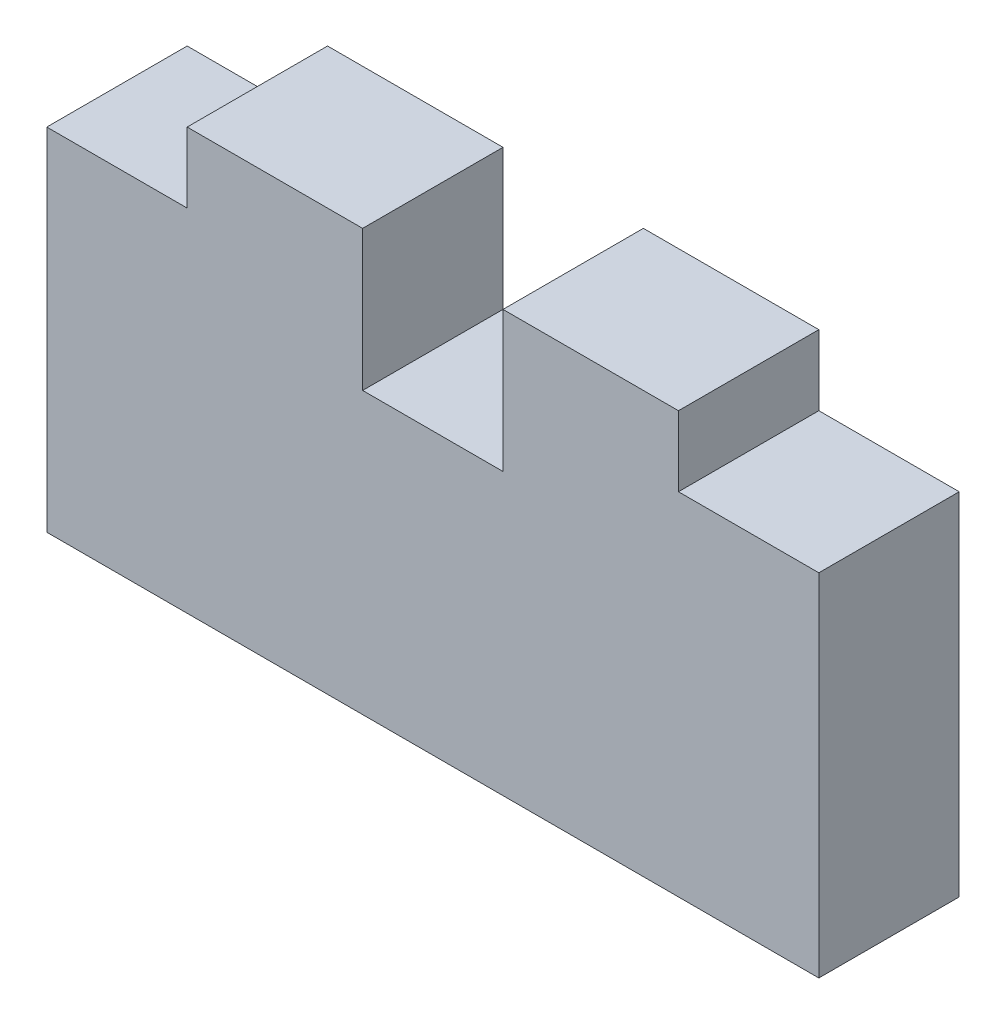
ISO-10303-21;
HEADER;
FILE_DESCRIPTION(('STEP AP214'),'2;1');
FILE_NAME('part.step','',(''),(''),'','','');
FILE_SCHEMA(('AUTOMOTIVE_DESIGN { 1 0 10303 214 1 1 1 1 }'));
ENDSEC;
DATA;
#1=APPLICATION_CONTEXT('core data for automotive mechanical design processes');
#2=APPLICATION_PROTOCOL_DEFINITION('international standard','automotive_design',2000,#1);
#3=PRODUCT_CONTEXT('',#1,'mechanical');
#4=PRODUCT('Part','Part','',(#3));
#5=PRODUCT_RELATED_PRODUCT_CATEGORY('part','',(#4));
#6=PRODUCT_DEFINITION_FORMATION('','',#4);
#7=PRODUCT_DEFINITION_CONTEXT('part definition',#1,'design');
#8=PRODUCT_DEFINITION('design','',#6,#7);
#9=PRODUCT_DEFINITION_SHAPE('','',#8);
#10=(LENGTH_UNIT() NAMED_UNIT(*) SI_UNIT(.MILLI.,.METRE.));
#11=(NAMED_UNIT(*) PLANE_ANGLE_UNIT() SI_UNIT($,.RADIAN.));
#12=(NAMED_UNIT(*) SI_UNIT($,.STERADIAN.) SOLID_ANGLE_UNIT());
#13=UNCERTAINTY_MEASURE_WITH_UNIT(LENGTH_MEASURE(1.E-05),#10,'distance_accuracy_value','');
#14=(GEOMETRIC_REPRESENTATION_CONTEXT(3) GLOBAL_UNCERTAINTY_ASSIGNED_CONTEXT((#13)) GLOBAL_UNIT_ASSIGNED_CONTEXT((#10,
#11,#12)) REPRESENTATION_CONTEXT('',''));
#15=CARTESIAN_POINT('',(0.,0.,0.));
#16=DIRECTION('',(0.,0.,1.));
#17=DIRECTION('',(1.,0.,0.));
#18=AXIS2_PLACEMENT_3D('',#15,#16,#17);
#19=CARTESIAN_POINT('',(7.14375,6.35,3.175));
#20=DIRECTION('',(-1.,0.,0.));
#21=DIRECTION('',(0.,-1.,0.));
#22=AXIS2_PLACEMENT_3D('',#19,#20,#21);
#23=PLANE('',#22);
#24=DIRECTION('',(0.,1.,0.));
#25=VECTOR('',#24,1.);
#26=CARTESIAN_POINT('',(7.14375,6.35,0.));
#27=LINE('',#26,#25);
#28=CARTESIAN_POINT('',(7.14375,6.35,0.));
#29=VERTEX_POINT('',#28);
#30=CARTESIAN_POINT('',(7.14375,9.525,0.));
#31=VERTEX_POINT('',#30);
#32=EDGE_CURVE('E153',#29,#31,#27,.T.);
#33=ORIENTED_EDGE('',*,*,#32,.T.);
#34=DIRECTION('',(0.,0.,-1.));
#35=VECTOR('',#34,1.);
#36=CARTESIAN_POINT('',(7.14375,9.525,3.175));
#37=LINE('',#36,#35);
#38=CARTESIAN_POINT('',(7.14375,9.525,3.175));
#39=VERTEX_POINT('',#38);
#40=EDGE_CURVE('E11',#39,#31,#37,.T.);
#41=ORIENTED_EDGE('',*,*,#40,.F.);
#42=DIRECTION('',(0.,1.,0.));
#43=VECTOR('',#42,1.);
#44=CARTESIAN_POINT('',(7.14375,6.35,3.175));
#45=LINE('',#44,#43);
#46=CARTESIAN_POINT('',(7.14375,6.35,3.175));
#47=VERTEX_POINT('',#46);
#48=EDGE_CURVE('E175',#47,#39,#45,.T.);
#49=ORIENTED_EDGE('',*,*,#48,.F.);
#50=DIRECTION('',(0.,0.,-1.));
#51=VECTOR('',#50,1.);
#52=CARTESIAN_POINT('',(7.14375,6.35,3.175));
#53=LINE('',#52,#51);
#54=EDGE_CURVE('E149',#47,#29,#53,.T.);
#55=ORIENTED_EDGE('',*,*,#54,.T.);
#56=EDGE_LOOP('',(#33,#41,#49,#55));
#57=FACE_BOUND('',#56,.T.);
#58=ADVANCED_FACE('F33',(#57),#23,.F.);
#59=CARTESIAN_POINT('',(7.14375,9.525,3.175));
#60=DIRECTION('',(0.,-1.,0.));
#61=DIRECTION('',(1.,0.,0.));
#62=AXIS2_PLACEMENT_3D('',#59,#60,#61);
#63=PLANE('',#62);
#64=DIRECTION('',(-1.,0.,0.));
#65=VECTOR('',#64,1.);
#66=CARTESIAN_POINT('',(7.14375,9.525,0.));
#67=LINE('',#66,#65);
#68=CARTESIAN_POINT('',(3.175,9.525,0.));
#69=VERTEX_POINT('',#68);
#70=EDGE_CURVE('E156',#31,#69,#67,.T.);
#71=ORIENTED_EDGE('',*,*,#70,.T.);
#72=DIRECTION('',(0.,0.,-1.));
#73=VECTOR('',#72,1.);
#74=CARTESIAN_POINT('',(3.175,9.525,3.175));
#75=LINE('',#74,#73);
#76=CARTESIAN_POINT('',(3.175,9.525,3.175));
#77=VERTEX_POINT('',#76);
#78=EDGE_CURVE('E41',#77,#69,#75,.T.);
#79=ORIENTED_EDGE('',*,*,#78,.F.);
#80=DIRECTION('',(-1.,0.,0.));
#81=VECTOR('',#80,1.);
#82=CARTESIAN_POINT('',(7.14375,9.525,3.175));
#83=LINE('',#82,#81);
#84=EDGE_CURVE('E104',#39,#77,#83,.T.);
#85=ORIENTED_EDGE('',*,*,#84,.F.);
#86=ORIENTED_EDGE('',*,*,#40,.T.);
#87=EDGE_LOOP('',(#71,#79,#85,#86));
#88=FACE_BOUND('',#87,.T.);
#89=ADVANCED_FACE('F253',(#88),#63,.F.);
#90=CARTESIAN_POINT('',(3.175,9.525,3.175));
#91=DIRECTION('',(1.,0.,0.));
#92=DIRECTION('',(0.,1.,0.));
#93=AXIS2_PLACEMENT_3D('',#90,#91,#92);
#94=PLANE('',#93);
#95=DIRECTION('',(0.,-1.,0.));
#96=VECTOR('',#95,1.);
#97=CARTESIAN_POINT('',(3.175,9.525,0.));
#98=LINE('',#97,#96);
#99=CARTESIAN_POINT('',(3.175,7.9375,0.));
#100=VERTEX_POINT('',#99);
#101=EDGE_CURVE('E158',#69,#100,#98,.T.);
#102=ORIENTED_EDGE('',*,*,#101,.T.);
#103=DIRECTION('',(0.,0.,-1.));
#104=VECTOR('',#103,1.);
#105=CARTESIAN_POINT('',(3.175,7.9375,3.175));
#106=LINE('',#105,#104);
#107=CARTESIAN_POINT('',(3.175,7.9375,3.175));
#108=VERTEX_POINT('',#107);
#109=EDGE_CURVE('E194',#108,#100,#106,.T.);
#110=ORIENTED_EDGE('',*,*,#109,.F.);
#111=DIRECTION('',(0.,-1.,0.));
#112=VECTOR('',#111,1.);
#113=CARTESIAN_POINT('',(3.175,9.525,3.175));
#114=LINE('',#113,#112);
#115=EDGE_CURVE('E202',#77,#108,#114,.T.);
#116=ORIENTED_EDGE('',*,*,#115,.F.);
#117=ORIENTED_EDGE('',*,*,#78,.T.);
#118=EDGE_LOOP('',(#102,#110,#116,#117));
#119=FACE_BOUND('',#118,.T.);
#120=ADVANCED_FACE('F200',(#119),#94,.F.);
#121=CARTESIAN_POINT('',(3.175,7.9375,3.175));
#122=DIRECTION('',(0.,-1.,0.));
#123=DIRECTION('',(0.,0.,-1.));
#124=AXIS2_PLACEMENT_3D('',#121,#122,#123);
#125=PLANE('',#124);
#126=DIRECTION('',(-1.,0.,0.));
#127=VECTOR('',#126,1.);
#128=CARTESIAN_POINT('',(3.175,7.9375,0.));
#129=LINE('',#128,#127);
#130=CARTESIAN_POINT('',(0.,7.9375,0.));
#131=VERTEX_POINT('',#130);
#132=EDGE_CURVE('E160',#100,#131,#129,.T.);
#133=ORIENTED_EDGE('',*,*,#132,.T.);
#134=DIRECTION('',(0.,0.,-1.));
#135=VECTOR('',#134,1.);
#136=CARTESIAN_POINT('',(0.,7.9375,3.175));
#137=LINE('',#136,#135);
#138=CARTESIAN_POINT('',(0.,7.9375,3.175));
#139=VERTEX_POINT('',#138);
#140=EDGE_CURVE('E191',#139,#131,#137,.T.);
#141=ORIENTED_EDGE('',*,*,#140,.F.);
#142=DIRECTION('',(-1.,0.,0.));
#143=VECTOR('',#142,1.);
#144=CARTESIAN_POINT('',(3.175,7.9375,3.175));
#145=LINE('',#144,#143);
#146=EDGE_CURVE('E220',#108,#139,#145,.T.);
#147=ORIENTED_EDGE('',*,*,#146,.F.);
#148=ORIENTED_EDGE('',*,*,#109,.T.);
#149=EDGE_LOOP('',(#133,#141,#147,#148));
#150=FACE_BOUND('',#149,.T.);
#151=ADVANCED_FACE('F211',(#150),#125,.F.);
#152=CARTESIAN_POINT('',(0.,7.9375,3.175));
#153=DIRECTION('',(1.,0.,0.));
#154=DIRECTION('',(0.,1.,0.));
#155=AXIS2_PLACEMENT_3D('',#152,#153,#154);
#156=PLANE('',#155);
#157=DIRECTION('',(0.,-1.,0.));
#158=VECTOR('',#157,1.);
#159=CARTESIAN_POINT('',(0.,7.9375,0.));
#160=LINE('',#159,#158);
#161=CARTESIAN_POINT('',(0.,0.,0.));
#162=VERTEX_POINT('',#161);
#163=EDGE_CURVE('E162',#131,#162,#160,.T.);
#164=ORIENTED_EDGE('',*,*,#163,.T.);
#165=DIRECTION('',(0.,0.,-1.));
#166=VECTOR('',#165,1.);
#167=CARTESIAN_POINT('',(0.,0.,3.175));
#168=LINE('',#167,#166);
#169=CARTESIAN_POINT('',(0.,0.,3.175));
#170=VERTEX_POINT('',#169);
#171=EDGE_CURVE('E188',#170,#162,#168,.T.);
#172=ORIENTED_EDGE('',*,*,#171,.F.);
#173=DIRECTION('',(0.,-1.,0.));
#174=VECTOR('',#173,1.);
#175=CARTESIAN_POINT('',(0.,7.9375,3.175));
#176=LINE('',#175,#174);
#177=EDGE_CURVE('E217',#139,#170,#176,.T.);
#178=ORIENTED_EDGE('',*,*,#177,.F.);
#179=ORIENTED_EDGE('',*,*,#140,.T.);
#180=EDGE_LOOP('',(#164,#172,#178,#179));
#181=FACE_BOUND('',#180,.T.);
#182=ADVANCED_FACE('F215',(#181),#156,.F.);
#183=CARTESIAN_POINT('',(0.,0.,3.175));
#184=DIRECTION('',(0.,1.,0.));
#185=DIRECTION('',(0.,0.,1.));
#186=AXIS2_PLACEMENT_3D('',#183,#184,#185);
#187=PLANE('',#186);
#188=DIRECTION('',(1.,0.,0.));
#189=VECTOR('',#188,1.);
#190=CARTESIAN_POINT('',(0.,0.,0.));
#191=LINE('',#190,#189);
#192=CARTESIAN_POINT('',(17.4625,0.,0.));
#193=VERTEX_POINT('',#192);
#194=EDGE_CURVE('E164',#162,#193,#191,.T.);
#195=ORIENTED_EDGE('',*,*,#194,.T.);
#196=DIRECTION('',(0.,0.,-1.));
#197=VECTOR('',#196,1.);
#198=CARTESIAN_POINT('',(17.4625,0.,3.175));
#199=LINE('',#198,#197);
#200=CARTESIAN_POINT('',(17.4625,0.,3.175));
#201=VERTEX_POINT('',#200);
#202=EDGE_CURVE('E185',#201,#193,#199,.T.);
#203=ORIENTED_EDGE('',*,*,#202,.F.);
#204=DIRECTION('',(1.,0.,0.));
#205=VECTOR('',#204,1.);
#206=CARTESIAN_POINT('',(0.,0.,3.175));
#207=LINE('',#206,#205);
#208=EDGE_CURVE('E219',#170,#201,#207,.T.);
#209=ORIENTED_EDGE('',*,*,#208,.F.);
#210=ORIENTED_EDGE('',*,*,#171,.T.);
#211=EDGE_LOOP('',(#195,#203,#209,#210));
#212=FACE_BOUND('',#211,.T.);
#213=ADVANCED_FACE('F266',(#212),#187,.F.);
#214=CARTESIAN_POINT('',(17.4625,0.,3.175));
#215=DIRECTION('',(-1.,0.,0.));
#216=DIRECTION('',(0.,0.,1.));
#217=AXIS2_PLACEMENT_3D('',#214,#215,#216);
#218=PLANE('',#217);
#219=DIRECTION('',(0.,1.,0.));
#220=VECTOR('',#219,1.);
#221=CARTESIAN_POINT('',(17.4625,0.,0.));
#222=LINE('',#221,#220);
#223=CARTESIAN_POINT('',(17.4625,7.9375,0.));
#224=VERTEX_POINT('',#223);
#225=EDGE_CURVE('E166',#193,#224,#222,.T.);
#226=ORIENTED_EDGE('',*,*,#225,.T.);
#227=DIRECTION('',(0.,0.,-1.));
#228=VECTOR('',#227,1.);
#229=CARTESIAN_POINT('',(17.4625,7.9375,3.175));
#230=LINE('',#229,#228);
#231=CARTESIAN_POINT('',(17.4625,7.9375,3.175));
#232=VERTEX_POINT('',#231);
#233=EDGE_CURVE('E182',#232,#224,#230,.T.);
#234=ORIENTED_EDGE('',*,*,#233,.F.);
#235=DIRECTION('',(0.,1.,0.));
#236=VECTOR('',#235,1.);
#237=CARTESIAN_POINT('',(17.4625,0.,3.175));
#238=LINE('',#237,#236);
#239=EDGE_CURVE('E222',#201,#232,#238,.T.);
#240=ORIENTED_EDGE('',*,*,#239,.F.);
#241=ORIENTED_EDGE('',*,*,#202,.T.);
#242=EDGE_LOOP('',(#226,#234,#240,#241));
#243=FACE_BOUND('',#242,.T.);
#244=ADVANCED_FACE('F269',(#243),#218,.F.);
#245=CARTESIAN_POINT('',(17.4625,7.9375,3.175));
#246=DIRECTION('',(0.,-1.,0.));
#247=DIRECTION('',(1.,0.,0.));
#248=AXIS2_PLACEMENT_3D('',#245,#246,#247);
#249=PLANE('',#248);
#250=DIRECTION('',(-1.,0.,0.));
#251=VECTOR('',#250,1.);
#252=CARTESIAN_POINT('',(17.4625,7.9375,0.));
#253=LINE('',#252,#251);
#254=CARTESIAN_POINT('',(14.2875,7.9375,0.));
#255=VERTEX_POINT('',#254);
#256=EDGE_CURVE('E168',#224,#255,#253,.T.);
#257=ORIENTED_EDGE('',*,*,#256,.T.);
#258=DIRECTION('',(0.,0.,-1.));
#259=VECTOR('',#258,1.);
#260=CARTESIAN_POINT('',(14.2875,7.9375,3.175));
#261=LINE('',#260,#259);
#262=CARTESIAN_POINT('',(14.2875,7.9375,3.175));
#263=VERTEX_POINT('',#262);
#264=EDGE_CURVE('E179',#263,#255,#261,.T.);
#265=ORIENTED_EDGE('',*,*,#264,.F.);
#266=DIRECTION('',(-1.,0.,0.));
#267=VECTOR('',#266,1.);
#268=CARTESIAN_POINT('',(17.4625,7.9375,3.175));
#269=LINE('',#268,#267);
#270=EDGE_CURVE('E228',#232,#263,#269,.T.);
#271=ORIENTED_EDGE('',*,*,#270,.F.);
#272=ORIENTED_EDGE('',*,*,#233,.T.);
#273=EDGE_LOOP('',(#257,#265,#271,#272));
#274=FACE_BOUND('',#273,.T.);
#275=ADVANCED_FACE('F234',(#274),#249,.F.);
#276=CARTESIAN_POINT('',(14.2875,7.9375,3.175));
#277=DIRECTION('',(-1.,0.,0.));
#278=DIRECTION('',(0.,0.,1.));
#279=AXIS2_PLACEMENT_3D('',#276,#277,#278);
#280=PLANE('',#279);
#281=DIRECTION('',(0.,1.,0.));
#282=VECTOR('',#281,1.);
#283=CARTESIAN_POINT('',(14.2875,7.9375,0.));
#284=LINE('',#283,#282);
#285=CARTESIAN_POINT('',(14.2875,9.525,0.));
#286=VERTEX_POINT('',#285);
#287=EDGE_CURVE('E170',#255,#286,#284,.T.);
#288=ORIENTED_EDGE('',*,*,#287,.T.);
#289=DIRECTION('',(0.,0.,-1.));
#290=VECTOR('',#289,1.);
#291=CARTESIAN_POINT('',(14.2875,9.525,3.175));
#292=LINE('',#291,#290);
#293=CARTESIAN_POINT('',(14.2875,9.525,3.175));
#294=VERTEX_POINT('',#293);
#295=EDGE_CURVE('E144',#294,#286,#292,.T.);
#296=ORIENTED_EDGE('',*,*,#295,.F.);
#297=DIRECTION('',(0.,1.,0.));
#298=VECTOR('',#297,1.);
#299=CARTESIAN_POINT('',(14.2875,7.9375,3.175));
#300=LINE('',#299,#298);
#301=EDGE_CURVE('E135',#263,#294,#300,.T.);
#302=ORIENTED_EDGE('',*,*,#301,.F.);
#303=ORIENTED_EDGE('',*,*,#264,.T.);
#304=EDGE_LOOP('',(#288,#296,#302,#303));
#305=FACE_BOUND('',#304,.T.);
#306=ADVANCED_FACE('F238',(#305),#280,.F.);
#307=CARTESIAN_POINT('',(14.2875,9.525,3.175));
#308=DIRECTION('',(0.,-1.,0.));
#309=DIRECTION('',(0.,0.,-1.));
#310=AXIS2_PLACEMENT_3D('',#307,#308,#309);
#311=PLANE('',#310);
#312=DIRECTION('',(-1.,0.,0.));
#313=VECTOR('',#312,1.);
#314=CARTESIAN_POINT('',(14.2875,9.525,0.));
#315=LINE('',#314,#313);
#316=CARTESIAN_POINT('',(10.31875,9.525,0.));
#317=VERTEX_POINT('',#316);
#318=EDGE_CURVE('E143',#286,#317,#315,.T.);
#319=ORIENTED_EDGE('',*,*,#318,.T.);
#320=DIRECTION('',(0.,0.,-1.));
#321=VECTOR('',#320,1.);
#322=CARTESIAN_POINT('',(10.31875,9.525,3.175));
#323=LINE('',#322,#321);
#324=CARTESIAN_POINT('',(10.31875,9.525,3.175));
#325=VERTEX_POINT('',#324);
#326=EDGE_CURVE('E140',#325,#317,#323,.T.);
#327=ORIENTED_EDGE('',*,*,#326,.F.);
#328=DIRECTION('',(-1.,0.,0.));
#329=VECTOR('',#328,1.);
#330=CARTESIAN_POINT('',(14.2875,9.525,3.175));
#331=LINE('',#330,#329);
#332=EDGE_CURVE('E129',#294,#325,#331,.T.);
#333=ORIENTED_EDGE('',*,*,#332,.F.);
#334=ORIENTED_EDGE('',*,*,#295,.T.);
#335=EDGE_LOOP('',(#319,#327,#333,#334));
#336=FACE_BOUND('',#335,.T.);
#337=ADVANCED_FACE('F141',(#336),#311,.F.);
#338=CARTESIAN_POINT('',(10.31875,9.525,3.175));
#339=DIRECTION('',(1.,0.,0.));
#340=DIRECTION('',(0.,1.,0.));
#341=AXIS2_PLACEMENT_3D('',#338,#339,#340);
#342=PLANE('',#341);
#343=DIRECTION('',(0.,-1.,0.));
#344=VECTOR('',#343,1.);
#345=CARTESIAN_POINT('',(10.31875,9.525,0.));
#346=LINE('',#345,#344);
#347=CARTESIAN_POINT('',(10.31875,6.35,0.));
#348=VERTEX_POINT('',#347);
#349=EDGE_CURVE('E90',#317,#348,#346,.T.);
#350=ORIENTED_EDGE('',*,*,#349,.T.);
#351=DIRECTION('',(0.,0.,-1.));
#352=VECTOR('',#351,1.);
#353=CARTESIAN_POINT('',(10.31875,6.35,3.175));
#354=LINE('',#353,#352);
#355=CARTESIAN_POINT('',(10.31875,6.35,3.175));
#356=VERTEX_POINT('',#355);
#357=EDGE_CURVE('E145',#356,#348,#354,.T.);
#358=ORIENTED_EDGE('',*,*,#357,.F.);
#359=DIRECTION('',(0.,-1.,0.));
#360=VECTOR('',#359,1.);
#361=CARTESIAN_POINT('',(10.31875,9.525,3.175));
#362=LINE('',#361,#360);
#363=EDGE_CURVE('E133',#325,#356,#362,.T.);
#364=ORIENTED_EDGE('',*,*,#363,.F.);
#365=ORIENTED_EDGE('',*,*,#326,.T.);
#366=EDGE_LOOP('',(#350,#358,#364,#365));
#367=FACE_BOUND('',#366,.T.);
#368=ADVANCED_FACE('F147',(#367),#342,.F.);
#369=CARTESIAN_POINT('',(10.31875,6.35,3.175));
#370=DIRECTION('',(0.,-1.,0.));
#371=DIRECTION('',(0.,0.,-1.));
#372=AXIS2_PLACEMENT_3D('',#369,#370,#371);
#373=PLANE('',#372);
#374=DIRECTION('',(-1.,0.,0.));
#375=VECTOR('',#374,1.);
#376=CARTESIAN_POINT('',(10.31875,6.35,0.));
#377=LINE('',#376,#375);
#378=EDGE_CURVE('E96',#348,#29,#377,.T.);
#379=ORIENTED_EDGE('',*,*,#378,.T.);
#380=ORIENTED_EDGE('',*,*,#54,.F.);
#381=DIRECTION('',(-1.,0.,0.));
#382=VECTOR('',#381,1.);
#383=CARTESIAN_POINT('',(10.31875,6.35,3.175));
#384=LINE('',#383,#382);
#385=EDGE_CURVE('E49',#356,#47,#384,.T.);
#386=ORIENTED_EDGE('',*,*,#385,.F.);
#387=ORIENTED_EDGE('',*,*,#357,.T.);
#388=EDGE_LOOP('',(#379,#380,#386,#387));
#389=FACE_BOUND('',#388,.T.);
#390=ADVANCED_FACE('F242',(#389),#373,.F.);
#391=CARTESIAN_POINT('',(0.,0.,3.175));
#392=DIRECTION('',(0.,0.,1.));
#393=DIRECTION('',(1.,0.,0.));
#394=AXIS2_PLACEMENT_3D('',#391,#392,#393);
#395=PLANE('',#394);
#396=ORIENTED_EDGE('',*,*,#48,.T.);
#397=ORIENTED_EDGE('',*,*,#84,.T.);
#398=ORIENTED_EDGE('',*,*,#115,.T.);
#399=ORIENTED_EDGE('',*,*,#146,.T.);
#400=ORIENTED_EDGE('',*,*,#177,.T.);
#401=ORIENTED_EDGE('',*,*,#208,.T.);
#402=ORIENTED_EDGE('',*,*,#239,.T.);
#403=ORIENTED_EDGE('',*,*,#270,.T.);
#404=ORIENTED_EDGE('',*,*,#301,.T.);
#405=ORIENTED_EDGE('',*,*,#332,.T.);
#406=ORIENTED_EDGE('',*,*,#363,.T.);
#407=ORIENTED_EDGE('',*,*,#385,.T.);
#408=EDGE_LOOP('',(#396,#397,#398,#399,#400,#401,#402,#403,#404,#405,#406,#407));
#409=FACE_BOUND('',#408,.T.);
#410=ADVANCED_FACE('F131',(#409),#395,.T.);
#411=CARTESIAN_POINT('',(0.,0.,0.));
#412=DIRECTION('',(0.,0.,1.));
#413=DIRECTION('',(1.,0.,0.));
#414=AXIS2_PLACEMENT_3D('',#411,#412,#413);
#415=PLANE('',#414);
#416=ORIENTED_EDGE('',*,*,#32,.F.);
#417=ORIENTED_EDGE('',*,*,#378,.F.);
#418=ORIENTED_EDGE('',*,*,#349,.F.);
#419=ORIENTED_EDGE('',*,*,#318,.F.);
#420=ORIENTED_EDGE('',*,*,#287,.F.);
#421=ORIENTED_EDGE('',*,*,#256,.F.);
#422=ORIENTED_EDGE('',*,*,#225,.F.);
#423=ORIENTED_EDGE('',*,*,#194,.F.);
#424=ORIENTED_EDGE('',*,*,#163,.F.);
#425=ORIENTED_EDGE('',*,*,#132,.F.);
#426=ORIENTED_EDGE('',*,*,#101,.F.);
#427=ORIENTED_EDGE('',*,*,#70,.F.);
#428=EDGE_LOOP('',(#416,#417,#418,#419,#420,#421,#422,#423,#424,#425,#426,#427));
#429=FACE_BOUND('',#428,.T.);
#430=ADVANCED_FACE('F206',(#429),#415,.F.);
#431=CLOSED_SHELL('',(#58,#89,#120,#151,#182,#213,#244,#275,#306,#337,#368,#390,#410,#430));
#432=MANIFOLD_SOLID_BREP('B2',#431);
#433=ADVANCED_BREP_SHAPE_REPRESENTATION('',(#18,#432),#14);
#434=SHAPE_DEFINITION_REPRESENTATION(#9,#433);
ENDSEC;
END-ISO-10303-21;
